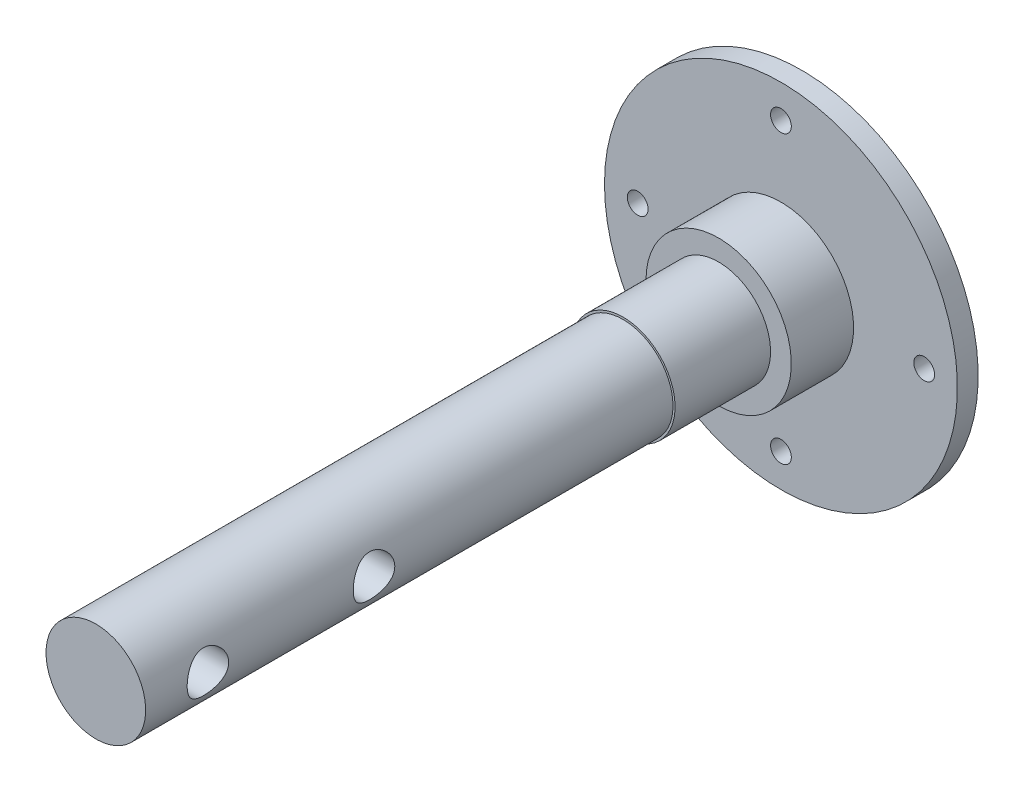
ISO-10303-21;
HEADER;
FILE_DESCRIPTION(('STEP AP214'),'2;1');
FILE_NAME('part.step','',(''),(''),'','','');
FILE_SCHEMA(('AUTOMOTIVE_DESIGN { 1 0 10303 214 1 1 1 1 }'));
ENDSEC;
DATA;
#1=APPLICATION_CONTEXT('core data for automotive mechanical design processes');
#2=APPLICATION_PROTOCOL_DEFINITION('international standard','automotive_design',2000,#1);
#3=PRODUCT_CONTEXT('',#1,'mechanical');
#4=PRODUCT('Part','Part','',(#3));
#5=PRODUCT_RELATED_PRODUCT_CATEGORY('part','',(#4));
#6=PRODUCT_DEFINITION_FORMATION('','',#4);
#7=PRODUCT_DEFINITION_CONTEXT('part definition',#1,'design');
#8=PRODUCT_DEFINITION('design','',#6,#7);
#9=PRODUCT_DEFINITION_SHAPE('','',#8);
#10=(LENGTH_UNIT() NAMED_UNIT(*) SI_UNIT(.MILLI.,.METRE.));
#11=(NAMED_UNIT(*) PLANE_ANGLE_UNIT() SI_UNIT($,.RADIAN.));
#12=(NAMED_UNIT(*) SI_UNIT($,.STERADIAN.) SOLID_ANGLE_UNIT());
#13=UNCERTAINTY_MEASURE_WITH_UNIT(LENGTH_MEASURE(1.E-05),#10,'distance_accuracy_value','');
#14=(GEOMETRIC_REPRESENTATION_CONTEXT(3) GLOBAL_UNCERTAINTY_ASSIGNED_CONTEXT((#13)) GLOBAL_UNIT_ASSIGNED_CONTEXT((#10,
#11,#12)) REPRESENTATION_CONTEXT('',''));
#15=CARTESIAN_POINT('',(0.,0.,0.));
#16=DIRECTION('',(0.,0.,1.));
#17=DIRECTION('',(1.,0.,0.));
#18=AXIS2_PLACEMENT_3D('',#15,#16,#17);
#19=CARTESIAN_POINT('',(0.,0.,34.));
#20=DIRECTION('',(0.,0.,1.));
#21=DIRECTION('',(1.,0.,0.));
#22=AXIS2_PLACEMENT_3D('',#19,#20,#21);
#23=PLANE('',#22);
#24=CARTESIAN_POINT('',(0.,0.,34.));
#25=DIRECTION('',(0.,0.,-1.));
#26=DIRECTION('',(-1.,0.,0.));
#27=AXIS2_PLACEMENT_3D('',#24,#25,#26);
#28=CIRCLE('',#27,2.4);
#29=CARTESIAN_POINT('',(-2.4,0.,34.));
#30=VERTEX_POINT('',#29);
#31=EDGE_CURVE('E18',#30,#30,#28,.T.);
#32=ORIENTED_EDGE('',*,*,#31,.F.);
#33=EDGE_LOOP('',(#32));
#34=FACE_BOUND('',#33,.T.);
#35=ADVANCED_FACE('F15',(#34),#23,.T.);
#36=CARTESIAN_POINT('',(-5.,0.,23.));
#37=DIRECTION('',(1.,0.,0.));
#38=DIRECTION('',(0.,0.,-1.));
#39=AXIS2_PLACEMENT_3D('',#36,#37,#38);
#40=CYLINDRICAL_SURFACE('',#39,1.);
#41=CARTESIAN_POINT('',(2.4,0.,22.));
#42=CARTESIAN_POINT('',(2.39999748115499,-0.0536228229681952,22.0000031120945));
#43=CARTESIAN_POINT('',(2.39818405700705,-0.107290047970871,22.0043342886357));
#44=CARTESIAN_POINT('',(2.39111423650814,-0.213056456016588,22.0214878732844));
#45=CARTESIAN_POINT('',(2.38585312144098,-0.26515338749602,22.0343219191932));
#46=CARTESIAN_POINT('',(2.37245149783701,-0.366144614490716,22.0679260271083));
#47=CARTESIAN_POINT('',(2.36431941079012,-0.415047786425472,22.0886728923997));
#48=CARTESIAN_POINT('',(2.34596548673147,-0.508649233344384,22.1374094613354));
#49=CARTESIAN_POINT('',(2.33574362342609,-0.553347455411432,22.1653992561116));
#50=CARTESIAN_POINT('',(2.31366222748149,-0.639560449319656,22.2293043569717));
#51=CARTESIAN_POINT('',(2.30174916747518,-0.680836032559526,22.2655236631235));
#52=CARTESIAN_POINT('',(2.27786084549728,-0.756930336478763,22.3442145378866));
#53=CARTESIAN_POINT('',(2.26588555780819,-0.79174612566388,22.3866889294875));
#54=CARTESIAN_POINT('',(2.24256824971376,-0.855629707085259,22.4792211252902));
#55=CARTESIAN_POINT('',(2.2312864351002,-0.884330111596901,22.5295493330614));
#56=CARTESIAN_POINT('',(2.21148468454706,-0.932751277448271,22.6348579253734));
#57=CARTESIAN_POINT('',(2.20296336043388,-0.952476554154447,22.689835954053));
#58=CARTESIAN_POINT('',(2.19022844559474,-0.981396781528443,22.8001229312771));
#59=CARTESIAN_POINT('',(2.18582710483227,-0.991053255415082,22.8552883405939));
#60=CARTESIAN_POINT('',(2.18129060994145,-1.00100167901162,22.9666185870403));
#61=CARTESIAN_POINT('',(2.1811531065847,-1.0012987854139,23.0227828567629));
#62=CARTESIAN_POINT('',(2.18500095572869,-0.992867605320561,23.1299200277));
#63=CARTESIAN_POINT('',(2.18867105883877,-0.98482945796529,23.1809608360927));
#64=CARTESIAN_POINT('',(2.19918785658243,-0.961113538189813,23.2808896333573));
#65=CARTESIAN_POINT('',(2.20603516210821,-0.945434296559616,23.3297772062386));
#66=CARTESIAN_POINT('',(2.22228963087426,-0.906575315154445,23.4252470574655));
#67=CARTESIAN_POINT('',(2.23174820770071,-0.883242942831145,23.4717580625766));
#68=CARTESIAN_POINT('',(2.25214705637918,-0.829848782644929,23.5603837598593));
#69=CARTESIAN_POINT('',(2.26308785714146,-0.799784590117635,23.602496873164));
#70=CARTESIAN_POINT('',(2.28634218605606,-0.730801761909807,23.6848741796629));
#71=CARTESIAN_POINT('',(2.29869364393779,-0.691350023532405,23.7246824656548));
#72=CARTESIAN_POINT('',(2.32260225864821,-0.606195421244399,23.7972819948124));
#73=CARTESIAN_POINT('',(2.3341590127733,-0.560489422651674,23.8300696979388));
#74=CARTESIAN_POINT('',(2.3555141309457,-0.462724683987973,23.8883699007824));
#75=CARTESIAN_POINT('',(2.36526436029952,-0.410541111858581,23.9136916782912));
#76=CARTESIAN_POINT('',(2.38152535186786,-0.302191305642431,23.9550010594861));
#77=CARTESIAN_POINT('',(2.38804256748526,-0.246033263254989,23.9710072690903));
#78=CARTESIAN_POINT('',(2.39501243620749,-0.157774818150987,23.9879829693992));
#79=CARTESIAN_POINT('',(2.39687553856488,-0.126423862499731,23.9924815819576));
#80=CARTESIAN_POINT('',(2.3993700552114,-0.0633871072702041,23.9984909933851));
#81=CARTESIAN_POINT('',(2.40000148911769,-0.0317013130330916,24.0000018398412));
#82=CARTESIAN_POINT('',(2.39999748115499,0.0536228229681957,23.9999968879055));
#83=CARTESIAN_POINT('',(2.39818405700705,0.107290047970872,23.9956657113643));
#84=CARTESIAN_POINT('',(2.39111423650814,0.213056456016588,23.9785121267156));
#85=CARTESIAN_POINT('',(2.38585312144098,0.26515338749602,23.9656780808068));
#86=CARTESIAN_POINT('',(2.37245149783701,0.366144614490716,23.9320739728917));
#87=CARTESIAN_POINT('',(2.36431941079012,0.415047786425473,23.9113271076003));
#88=CARTESIAN_POINT('',(2.34596548673147,0.508649233344385,23.8625905386646));
#89=CARTESIAN_POINT('',(2.33574362342609,0.553347455411433,23.8346007438884));
#90=CARTESIAN_POINT('',(2.31366222748149,0.639560449319656,23.7706956430283));
#91=CARTESIAN_POINT('',(2.30174916747518,0.680836032559526,23.7344763368765));
#92=CARTESIAN_POINT('',(2.27786084549728,0.756930336478764,23.6557854621134));
#93=CARTESIAN_POINT('',(2.26588555780819,0.791746125663881,23.6133110705125));
#94=CARTESIAN_POINT('',(2.24256824971376,0.855629707085261,23.5207788747098));
#95=CARTESIAN_POINT('',(2.2312864351002,0.884330111596903,23.4704506669385));
#96=CARTESIAN_POINT('',(2.21148468454706,0.932751277448272,23.3651420746266));
#97=CARTESIAN_POINT('',(2.20296336043388,0.952476554154447,23.310164045947));
#98=CARTESIAN_POINT('',(2.19022844559474,0.981396781528443,23.1998770687229));
#99=CARTESIAN_POINT('',(2.18582710483227,0.991053255415082,23.1447116594061));
#100=CARTESIAN_POINT('',(2.18129060994145,1.00100167901162,23.0333814129597));
#101=CARTESIAN_POINT('',(2.1811531065847,1.0012987854139,22.9772171432371));
#102=CARTESIAN_POINT('',(2.18500095572869,0.992867605320561,22.8700799723));
#103=CARTESIAN_POINT('',(2.18867105883877,0.984829457965289,22.8190391639073));
#104=CARTESIAN_POINT('',(2.19918785658243,0.961113538189813,22.7191103666427));
#105=CARTESIAN_POINT('',(2.20603516210821,0.945434296559616,22.6702227937614));
#106=CARTESIAN_POINT('',(2.22228963087426,0.906575315154445,22.5747529425345));
#107=CARTESIAN_POINT('',(2.23174820770071,0.883242942831145,22.5282419374234));
#108=CARTESIAN_POINT('',(2.25214705637918,0.829848782644929,22.4396162401407));
#109=CARTESIAN_POINT('',(2.26308785714146,0.799784590117635,22.397503126836));
#110=CARTESIAN_POINT('',(2.28634218605606,0.730801761909807,22.3151258203371));
#111=CARTESIAN_POINT('',(2.29869364393779,0.691350023532405,22.2753175343452));
#112=CARTESIAN_POINT('',(2.32260225864821,0.6061954212444,22.2027180051876));
#113=CARTESIAN_POINT('',(2.3341590127733,0.560489422651675,22.1699303020612));
#114=CARTESIAN_POINT('',(2.3555141309457,0.462724683987973,22.1116300992176));
#115=CARTESIAN_POINT('',(2.36526436029952,0.410541111858581,22.0863083217088));
#116=CARTESIAN_POINT('',(2.38152535186786,0.302191305642431,22.0449989405139));
#117=CARTESIAN_POINT('',(2.38804256748526,0.246033263254989,22.0289927309097));
#118=CARTESIAN_POINT('',(2.39501243620749,0.157774818150987,22.0120170306008));
#119=CARTESIAN_POINT('',(2.39687553856488,0.126423862499731,22.0075184180424));
#120=CARTESIAN_POINT('',(2.3993700552114,0.0633871072702043,22.0015090066149));
#121=CARTESIAN_POINT('',(2.40000148911769,0.0317013130330918,21.9999981601588));
#122=CARTESIAN_POINT('',(2.4,0.,22.));
#123=B_SPLINE_CURVE_WITH_KNOTS('',3,(#41,#42,#43,#44,#45,#46,#47,#48,#49,#50,#51,#52,#53,#54,
#55,#56,#57,#58,#59,#60,#61,#62,#63,#64,#65,#66,#67,#68,#69,#70,#71,#72,#73,#74,#75,#76,#77,#78,
#79,#80,#81,#82,#83,#84,#85,#86,#87,#88,#89,#90,#91,#92,#93,#94,#95,#96,#97,#98,#99,#100,#101,
#102,#103,#104,#105,#106,#107,#108,#109,#110,#111,#112,#113,#114,#115,#116,#117,#118,#119,#120,
#121,#122),.UNSPECIFIED.,.T.,.F.,(4,2,2,2,2,2,2,2,2,2,2,2,2,2,2,2,2,2,2,2,2,2,2,2,2,2,2,2,2,2,2,
2,2,2,2,2,2,2,2,2,4),(0.,0.160745178571958,0.321710823406614,0.482208174194472,
0.642707544487954,0.810549531057266,0.978467500046993,1.15465270263012,1.33074916856349,
1.49836210995007,1.66588270070444,1.82056119016139,1.97526943254251,2.13327263110284,
2.29133236006593,2.46273006219595,2.63421398696243,2.80975981529697,2.98495381316104,
3.07998637779003,3.17501742879404,3.335762607366,3.49672825220066,3.65722560298852,
3.817724973282,3.98556695985131,4.15348492884104,4.32967013142416,4.50576659735754,
4.67337953874412,4.84090012949848,4.99557861895544,5.15028686133656,5.30829005989688,
5.46634978885998,5.63774749098999,5.80923141575648,5.98477724409101,6.15997124195508,
6.25500380658407,6.35003485758809),.UNSPECIFIED.);
#124=CARTESIAN_POINT('',(2.4,0.,22.));
#125=VERTEX_POINT('',#124);
#126=EDGE_CURVE('E75',#125,#125,#123,.T.);
#127=ORIENTED_EDGE('',*,*,#126,.F.);
#128=EDGE_LOOP('',(#127));
#129=FACE_BOUND('',#128,.T.);
#130=CARTESIAN_POINT('',(-2.4,0.,24.));
#131=CARTESIAN_POINT('',(-2.39999748115499,-0.0536228229681954,23.9999968879055));
#132=CARTESIAN_POINT('',(-2.39818405700705,-0.107290047970871,23.9956657113643));
#133=CARTESIAN_POINT('',(-2.39111423650814,-0.213056456016588,23.9785121267156));
#134=CARTESIAN_POINT('',(-2.38585312144098,-0.26515338749602,23.9656780808068));
#135=CARTESIAN_POINT('',(-2.37245149783701,-0.366144614490716,23.9320739728917));
#136=CARTESIAN_POINT('',(-2.36431941079012,-0.415047786425472,23.9113271076003));
#137=CARTESIAN_POINT('',(-2.34596548673147,-0.508649233344384,23.8625905386646));
#138=CARTESIAN_POINT('',(-2.33574362342609,-0.553347455411432,23.8346007438884));
#139=CARTESIAN_POINT('',(-2.31366222748149,-0.639560449319655,23.7706956430283));
#140=CARTESIAN_POINT('',(-2.30174916747518,-0.680836032559525,23.7344763368765));
#141=CARTESIAN_POINT('',(-2.27786084549728,-0.756930336478762,23.6557854621134));
#142=CARTESIAN_POINT('',(-2.26588555780819,-0.791746125663879,23.6133110705125));
#143=CARTESIAN_POINT('',(-2.24256824971376,-0.855629707085259,23.5207788747098));
#144=CARTESIAN_POINT('',(-2.2312864351002,-0.8843301115969,23.4704506669386));
#145=CARTESIAN_POINT('',(-2.21148468454706,-0.932751277448271,23.3651420746266));
#146=CARTESIAN_POINT('',(-2.20296336043388,-0.952476554154446,23.310164045947));
#147=CARTESIAN_POINT('',(-2.19022844559474,-0.981396781528443,23.1998770687229));
#148=CARTESIAN_POINT('',(-2.18582710483227,-0.991053255415082,23.1447116594061));
#149=CARTESIAN_POINT('',(-2.18129060994145,-1.00100167901162,23.0333814129597));
#150=CARTESIAN_POINT('',(-2.1811531065847,-1.0012987854139,22.9772171432371));
#151=CARTESIAN_POINT('',(-2.18500095572869,-0.992867605320561,22.8700799723));
#152=CARTESIAN_POINT('',(-2.18867105883877,-0.984829457965289,22.8190391639073));
#153=CARTESIAN_POINT('',(-2.19918785658243,-0.961113538189812,22.7191103666427));
#154=CARTESIAN_POINT('',(-2.20603516210821,-0.945434296559616,22.6702227937614));
#155=CARTESIAN_POINT('',(-2.22228963087426,-0.906575315154445,22.5747529425345));
#156=CARTESIAN_POINT('',(-2.23174820770071,-0.883242942831145,22.5282419374234));
#157=CARTESIAN_POINT('',(-2.25214705637918,-0.829848782644929,22.4396162401407));
#158=CARTESIAN_POINT('',(-2.26308785714146,-0.799784590117635,22.397503126836));
#159=CARTESIAN_POINT('',(-2.28634218605606,-0.730801761909807,22.3151258203371));
#160=CARTESIAN_POINT('',(-2.29869364393779,-0.691350023532405,22.2753175343452));
#161=CARTESIAN_POINT('',(-2.32260225864821,-0.606195421244399,22.2027180051876));
#162=CARTESIAN_POINT('',(-2.3341590127733,-0.560489422651674,22.1699303020612));
#163=CARTESIAN_POINT('',(-2.3555141309457,-0.462724683987973,22.1116300992176));
#164=CARTESIAN_POINT('',(-2.36526436029952,-0.410541111858581,22.0863083217088));
#165=CARTESIAN_POINT('',(-2.38152535186786,-0.302191305642431,22.0449989405139));
#166=CARTESIAN_POINT('',(-2.38804256748526,-0.246033263254989,22.0289927309097));
#167=CARTESIAN_POINT('',(-2.39501243620749,-0.157774818150987,22.0120170306008));
#168=CARTESIAN_POINT('',(-2.39687553856488,-0.126423862499731,22.0075184180424));
#169=CARTESIAN_POINT('',(-2.3993700552114,-0.0633871072702043,22.0015090066149));
#170=CARTESIAN_POINT('',(-2.40000148911769,-0.0317013130330918,21.9999981601588));
#171=CARTESIAN_POINT('',(-2.39999748115499,0.0536228229681952,22.0000031120945));
#172=CARTESIAN_POINT('',(-2.39818405700705,0.107290047970871,22.0043342886357));
#173=CARTESIAN_POINT('',(-2.39111423650814,0.213056456016588,22.0214878732844));
#174=CARTESIAN_POINT('',(-2.38585312144098,0.26515338749602,22.0343219191932));
#175=CARTESIAN_POINT('',(-2.37245149783701,0.366144614490715,22.0679260271083));
#176=CARTESIAN_POINT('',(-2.36431941079012,0.415047786425472,22.0886728923997));
#177=CARTESIAN_POINT('',(-2.34596548673147,0.508649233344384,22.1374094613354));
#178=CARTESIAN_POINT('',(-2.33574362342609,0.553347455411432,22.1653992561116));
#179=CARTESIAN_POINT('',(-2.31366222748149,0.639560449319656,22.2293043569717));
#180=CARTESIAN_POINT('',(-2.30174916747518,0.680836032559526,22.2655236631235));
#181=CARTESIAN_POINT('',(-2.27786084549728,0.756930336478763,22.3442145378866));
#182=CARTESIAN_POINT('',(-2.26588555780819,0.79174612566388,22.3866889294875));
#183=CARTESIAN_POINT('',(-2.24256824971376,0.85562970708526,22.4792211252902));
#184=CARTESIAN_POINT('',(-2.2312864351002,0.884330111596902,22.5295493330615));
#185=CARTESIAN_POINT('',(-2.21148468454706,0.932751277448272,22.6348579253734));
#186=CARTESIAN_POINT('',(-2.20296336043388,0.952476554154447,22.689835954053));
#187=CARTESIAN_POINT('',(-2.19022844559474,0.981396781528443,22.8001229312771));
#188=CARTESIAN_POINT('',(-2.18582710483227,0.991053255415082,22.8552883405939));
#189=CARTESIAN_POINT('',(-2.18129060994145,1.00100167901162,22.9666185870403));
#190=CARTESIAN_POINT('',(-2.1811531065847,1.0012987854139,23.0227828567629));
#191=CARTESIAN_POINT('',(-2.18500095572869,0.992867605320561,23.1299200277));
#192=CARTESIAN_POINT('',(-2.18867105883877,0.984829457965289,23.1809608360927));
#193=CARTESIAN_POINT('',(-2.19918785658243,0.961113538189812,23.2808896333573));
#194=CARTESIAN_POINT('',(-2.20603516210821,0.945434296559616,23.3297772062386));
#195=CARTESIAN_POINT('',(-2.22228963087426,0.906575315154445,23.4252470574655));
#196=CARTESIAN_POINT('',(-2.23174820770071,0.883242942831145,23.4717580625766));
#197=CARTESIAN_POINT('',(-2.25214705637918,0.829848782644929,23.5603837598593));
#198=CARTESIAN_POINT('',(-2.26308785714146,0.799784590117635,23.602496873164));
#199=CARTESIAN_POINT('',(-2.28634218605606,0.730801761909807,23.6848741796629));
#200=CARTESIAN_POINT('',(-2.29869364393779,0.691350023532405,23.7246824656548));
#201=CARTESIAN_POINT('',(-2.32260225864821,0.606195421244399,23.7972819948124));
#202=CARTESIAN_POINT('',(-2.3341590127733,0.560489422651674,23.8300696979388));
#203=CARTESIAN_POINT('',(-2.3555141309457,0.462724683987973,23.8883699007824));
#204=CARTESIAN_POINT('',(-2.36526436029952,0.410541111858581,23.9136916782912));
#205=CARTESIAN_POINT('',(-2.38152535186786,0.302191305642431,23.9550010594861));
#206=CARTESIAN_POINT('',(-2.38804256748526,0.246033263254989,23.9710072690903));
#207=CARTESIAN_POINT('',(-2.39501243620749,0.157774818150987,23.9879829693992));
#208=CARTESIAN_POINT('',(-2.39687553856488,0.12642386249973,23.9924815819576));
#209=CARTESIAN_POINT('',(-2.3993700552114,0.0633871072702039,23.9984909933851));
#210=CARTESIAN_POINT('',(-2.40000148911769,0.0317013130330916,24.0000018398412));
#211=CARTESIAN_POINT('',(-2.4,0.,24.));
#212=B_SPLINE_CURVE_WITH_KNOTS('',3,(#130,#131,#132,#133,#134,#135,#136,#137,#138,#139,#140,
#141,#142,#143,#144,#145,#146,#147,#148,#149,#150,#151,#152,#153,#154,#155,#156,#157,#158,#159,
#160,#161,#162,#163,#164,#165,#166,#167,#168,#169,#170,#171,#172,#173,#174,#175,#176,#177,#178,
#179,#180,#181,#182,#183,#184,#185,#186,#187,#188,#189,#190,#191,#192,#193,#194,#195,#196,#197,
#198,#199,#200,#201,#202,#203,#204,#205,#206,#207,#208,#209,#210,#211),.UNSPECIFIED.,.T.,.F.,(4,
2,2,2,2,2,2,2,2,2,2,2,2,2,2,2,2,2,2,2,2,2,2,2,2,2,2,2,2,2,2,2,2,2,2,2,2,2,2,2,4),(0.,
0.160745178571958,0.321710823406614,0.482208174194472,0.642707544487954,0.810549531057265,
0.978467500046993,1.15465270263011,1.33074916856349,1.49836210995007,1.66588270070444,
1.82056119016139,1.97526943254251,2.13327263110284,2.29133236006593,2.46273006219595,
2.63421398696243,2.80975981529697,2.98495381316104,3.07998637779003,3.17501742879404,
3.335762607366,3.49672825220066,3.65722560298852,3.817724973282,3.98556695985131,
4.15348492884104,4.32967013142416,4.50576659735753,4.67337953874412,4.84090012949848,
4.99557861895544,5.15028686133656,5.30829005989688,5.46634978885998,5.63774749099,
5.80923141575648,5.98477724409101,6.15997124195508,6.25500380658407,6.35003485758809),.UNSPECIFIED.);
#213=CARTESIAN_POINT('',(-2.4,0.,24.));
#214=VERTEX_POINT('',#213);
#215=EDGE_CURVE('E94',#214,#214,#212,.T.);
#216=ORIENTED_EDGE('',*,*,#215,.F.);
#217=EDGE_LOOP('',(#216));
#218=FACE_BOUND('',#217,.T.);
#219=ADVANCED_FACE('F98',(#129,#218),#40,.F.);
#220=CARTESIAN_POINT('',(-5.,0.,31.));
#221=DIRECTION('',(1.,0.,0.));
#222=DIRECTION('',(0.,0.,-1.));
#223=AXIS2_PLACEMENT_3D('',#220,#221,#222);
#224=CYLINDRICAL_SURFACE('',#223,1.);
#225=CARTESIAN_POINT('',(2.4,0.,30.));
#226=CARTESIAN_POINT('',(2.39999748115499,-0.0536228229681952,30.0000031120945));
#227=CARTESIAN_POINT('',(2.39818405700705,-0.107290047970871,30.0043342886357));
#228=CARTESIAN_POINT('',(2.39111423650814,-0.213056456016588,30.0214878732844));
#229=CARTESIAN_POINT('',(2.38585312144098,-0.26515338749602,30.0343219191932));
#230=CARTESIAN_POINT('',(2.37245149783701,-0.366144614490716,30.0679260271083));
#231=CARTESIAN_POINT('',(2.36431941079012,-0.415047786425472,30.0886728923997));
#232=CARTESIAN_POINT('',(2.34596548673147,-0.508649233344384,30.1374094613354));
#233=CARTESIAN_POINT('',(2.33574362342609,-0.553347455411432,30.1653992561116));
#234=CARTESIAN_POINT('',(2.31366222748149,-0.639560449319656,30.2293043569717));
#235=CARTESIAN_POINT('',(2.30174916747518,-0.680836032559526,30.2655236631235));
#236=CARTESIAN_POINT('',(2.27786084549728,-0.756930336478763,30.3442145378866));
#237=CARTESIAN_POINT('',(2.26588555780819,-0.79174612566388,30.3866889294875));
#238=CARTESIAN_POINT('',(2.24256824971376,-0.855629707085259,30.4792211252902));
#239=CARTESIAN_POINT('',(2.2312864351002,-0.884330111596901,30.5295493330614));
#240=CARTESIAN_POINT('',(2.21148468454706,-0.932751277448271,30.6348579253734));
#241=CARTESIAN_POINT('',(2.20296336043388,-0.952476554154447,30.689835954053));
#242=CARTESIAN_POINT('',(2.19022844559474,-0.981396781528443,30.8001229312771));
#243=CARTESIAN_POINT('',(2.18582710483227,-0.991053255415082,30.8552883405939));
#244=CARTESIAN_POINT('',(2.18129060994145,-1.00100167901162,30.9666185870403));
#245=CARTESIAN_POINT('',(2.1811531065847,-1.0012987854139,31.0227828567629));
#246=CARTESIAN_POINT('',(2.18500095572869,-0.992867605320561,31.1299200277));
#247=CARTESIAN_POINT('',(2.18867105883877,-0.984829457965289,31.1809608360927));
#248=CARTESIAN_POINT('',(2.19918785658243,-0.961113538189812,31.2808896333573));
#249=CARTESIAN_POINT('',(2.20603516210821,-0.945434296559615,31.3297772062386));
#250=CARTESIAN_POINT('',(2.22228963087426,-0.906575315154444,31.4252470574655));
#251=CARTESIAN_POINT('',(2.23174820770071,-0.883242942831145,31.4717580625766));
#252=CARTESIAN_POINT('',(2.25214705637918,-0.829848782644929,31.5603837598593));
#253=CARTESIAN_POINT('',(2.26308785714146,-0.799784590117634,31.602496873164));
#254=CARTESIAN_POINT('',(2.28634218605606,-0.730801761909805,31.6848741796629));
#255=CARTESIAN_POINT('',(2.29869364393779,-0.691350023532403,31.7246824656548));
#256=CARTESIAN_POINT('',(2.32260225864821,-0.606195421244397,31.7972819948124));
#257=CARTESIAN_POINT('',(2.3341590127733,-0.560489422651671,31.8300696979388));
#258=CARTESIAN_POINT('',(2.3555141309457,-0.46272468398797,31.8883699007824));
#259=CARTESIAN_POINT('',(2.36526436029953,-0.410541111858579,31.9136916782912));
#260=CARTESIAN_POINT('',(2.38152535186786,-0.30219130564243,31.9550010594861));
#261=CARTESIAN_POINT('',(2.38804256748526,-0.246033263254987,31.9710072690903));
#262=CARTESIAN_POINT('',(2.39501243620749,-0.157774818150987,31.9879829693992));
#263=CARTESIAN_POINT('',(2.39687553856488,-0.126423862499731,31.9924815819576));
#264=CARTESIAN_POINT('',(2.3993700552114,-0.0633871072702047,31.9984909933851));
#265=CARTESIAN_POINT('',(2.40000148911769,-0.0317013130330915,32.0000018398412));
#266=CARTESIAN_POINT('',(2.39999748115499,0.0536228229681959,31.9999968879055));
#267=CARTESIAN_POINT('',(2.39818405700705,0.107290047970872,31.9956657113643));
#268=CARTESIAN_POINT('',(2.39111423650814,0.213056456016587,31.9785121267156));
#269=CARTESIAN_POINT('',(2.38585312144098,0.265153387496019,31.9656780808068));
#270=CARTESIAN_POINT('',(2.37245149783701,0.366144614490715,31.9320739728918));
#271=CARTESIAN_POINT('',(2.36431941079012,0.415047786425472,31.9113271076003));
#272=CARTESIAN_POINT('',(2.34596548673147,0.508649233344383,31.8625905386646));
#273=CARTESIAN_POINT('',(2.33574362342609,0.553347455411429,31.8346007438884));
#274=CARTESIAN_POINT('',(2.31366222748149,0.639560449319653,31.7706956430283));
#275=CARTESIAN_POINT('',(2.30174916747518,0.680836032559526,31.7344763368765));
#276=CARTESIAN_POINT('',(2.27786084549728,0.756930336478763,31.6557854621134));
#277=CARTESIAN_POINT('',(2.26588555780819,0.791746125663879,31.6133110705125));
#278=CARTESIAN_POINT('',(2.24256824971376,0.855629707085257,31.5207788747098));
#279=CARTESIAN_POINT('',(2.2312864351002,0.884330111596899,31.4704506669386));
#280=CARTESIAN_POINT('',(2.21148468454706,0.932751277448269,31.3651420746266));
#281=CARTESIAN_POINT('',(2.20296336043388,0.952476554154445,31.310164045947));
#282=CARTESIAN_POINT('',(2.19022844559474,0.981396781528442,31.1998770687229));
#283=CARTESIAN_POINT('',(2.18582710483227,0.991053255415082,31.1447116594061));
#284=CARTESIAN_POINT('',(2.18129060994144,1.00100167901162,31.0333814129597));
#285=CARTESIAN_POINT('',(2.1811531065847,1.0012987854139,30.9772171432371));
#286=CARTESIAN_POINT('',(2.18500095572869,0.992867605320562,30.8700799723));
#287=CARTESIAN_POINT('',(2.18867105883877,0.98482945796529,30.8190391639073));
#288=CARTESIAN_POINT('',(2.19918785658243,0.961113538189814,30.7191103666427));
#289=CARTESIAN_POINT('',(2.20603516210821,0.945434296559617,30.6702227937614));
#290=CARTESIAN_POINT('',(2.22228963087426,0.906575315154446,30.5747529425345));
#291=CARTESIAN_POINT('',(2.23174820770071,0.883242942831146,30.5282419374234));
#292=CARTESIAN_POINT('',(2.25214705637918,0.829848782644929,30.4396162401407));
#293=CARTESIAN_POINT('',(2.26308785714146,0.799784590117635,30.397503126836));
#294=CARTESIAN_POINT('',(2.28634218605606,0.730801761909807,30.3151258203371));
#295=CARTESIAN_POINT('',(2.29869364393779,0.691350023532405,30.2753175343452));
#296=CARTESIAN_POINT('',(2.32260225864821,0.6061954212444,30.2027180051876));
#297=CARTESIAN_POINT('',(2.3341590127733,0.560489422651675,30.1699303020612));
#298=CARTESIAN_POINT('',(2.3555141309457,0.462724683987974,30.1116300992176));
#299=CARTESIAN_POINT('',(2.36526436029952,0.410541111858583,30.0863083217088));
#300=CARTESIAN_POINT('',(2.38152535186786,0.302191305642433,30.0449989405139));
#301=CARTESIAN_POINT('',(2.38804256748526,0.24603326325499,30.0289927309097));
#302=CARTESIAN_POINT('',(2.39501243620749,0.157774818150988,30.0120170306008));
#303=CARTESIAN_POINT('',(2.39687553856488,0.126423862499732,30.0075184180424));
#304=CARTESIAN_POINT('',(2.3993700552114,0.0633871072702053,30.0015090066149));
#305=CARTESIAN_POINT('',(2.40000148911769,0.0317013130330923,29.9999981601588));
#306=CARTESIAN_POINT('',(2.4,0.,30.));
#307=B_SPLINE_CURVE_WITH_KNOTS('',3,(#225,#226,#227,#228,#229,#230,#231,#232,#233,#234,#235,
#236,#237,#238,#239,#240,#241,#242,#243,#244,#245,#246,#247,#248,#249,#250,#251,#252,#253,#254,
#255,#256,#257,#258,#259,#260,#261,#262,#263,#264,#265,#266,#267,#268,#269,#270,#271,#272,#273,
#274,#275,#276,#277,#278,#279,#280,#281,#282,#283,#284,#285,#286,#287,#288,#289,#290,#291,#292,
#293,#294,#295,#296,#297,#298,#299,#300,#301,#302,#303,#304,#305,#306),.UNSPECIFIED.,.T.,.F.,(4,
2,2,2,2,2,2,2,2,2,2,2,2,2,2,2,2,2,2,2,2,2,2,2,2,2,2,2,2,2,2,2,2,2,2,2,2,2,2,2,4),(0.,
0.160745178571958,0.321710823406614,0.482208174194472,0.642707544487954,0.810549531057266,
0.978467500046993,1.15465270263012,1.33074916856349,1.49836210995007,1.66588270070444,
1.82056119016139,1.97526943254252,2.13327263110283,2.29133236006593,2.46273006219595,
2.63421398696244,2.80975981529697,2.98495381316104,3.07998637779003,3.17501742879404,
3.335762607366,3.49672825220066,3.65722560298851,3.817724973282,3.98556695985131,
4.15348492884104,4.32967013142416,4.50576659735752,4.67337953874411,4.84090012949848,
4.99557861895543,5.15028686133655,5.30829005989688,5.46634978885998,5.63774749099,
5.80923141575648,5.98477724409101,6.15997124195508,6.25500380658407,6.35003485758809),.UNSPECIFIED.);
#308=CARTESIAN_POINT('',(2.4,0.,30.));
#309=VERTEX_POINT('',#308);
#310=EDGE_CURVE('E68',#309,#309,#307,.T.);
#311=ORIENTED_EDGE('',*,*,#310,.F.);
#312=EDGE_LOOP('',(#311));
#313=FACE_BOUND('',#312,.T.);
#314=CARTESIAN_POINT('',(-2.4,0.,32.));
#315=CARTESIAN_POINT('',(-2.39999748115499,-0.0536228229681953,31.9999968879055));
#316=CARTESIAN_POINT('',(-2.39818405700705,-0.107290047970871,31.9956657113643));
#317=CARTESIAN_POINT('',(-2.39111423650814,-0.213056456016588,31.9785121267156));
#318=CARTESIAN_POINT('',(-2.38585312144098,-0.26515338749602,31.9656780808068));
#319=CARTESIAN_POINT('',(-2.37245149783701,-0.366144614490716,31.9320739728918));
#320=CARTESIAN_POINT('',(-2.36431941079012,-0.415047786425471,31.9113271076003));
#321=CARTESIAN_POINT('',(-2.34596548673147,-0.508649233344384,31.8625905386646));
#322=CARTESIAN_POINT('',(-2.33574362342609,-0.553347455411432,31.8346007438884));
#323=CARTESIAN_POINT('',(-2.31366222748149,-0.639560449319656,31.7706956430283));
#324=CARTESIAN_POINT('',(-2.30174916747518,-0.680836032559526,31.7344763368765));
#325=CARTESIAN_POINT('',(-2.27786084549728,-0.756930336478763,31.6557854621134));
#326=CARTESIAN_POINT('',(-2.26588555780819,-0.791746125663881,31.6133110705125));
#327=CARTESIAN_POINT('',(-2.24256824971376,-0.85562970708526,31.5207788747098));
#328=CARTESIAN_POINT('',(-2.2312864351002,-0.8843301115969,31.4704506669386));
#329=CARTESIAN_POINT('',(-2.21148468454706,-0.93275127744827,31.3651420746266));
#330=CARTESIAN_POINT('',(-2.20296336043388,-0.952476554154446,31.310164045947));
#331=CARTESIAN_POINT('',(-2.19022844559474,-0.981396781528443,31.1998770687229));
#332=CARTESIAN_POINT('',(-2.18582710483227,-0.991053255415082,31.1447116594061));
#333=CARTESIAN_POINT('',(-2.18129060994145,-1.00100167901162,31.0333814129597));
#334=CARTESIAN_POINT('',(-2.1811531065847,-1.0012987854139,30.9772171432371));
#335=CARTESIAN_POINT('',(-2.18500095572869,-0.992867605320561,30.8700799723));
#336=CARTESIAN_POINT('',(-2.18867105883877,-0.984829457965289,30.8190391639073));
#337=CARTESIAN_POINT('',(-2.19918785658243,-0.961113538189812,30.7191103666427));
#338=CARTESIAN_POINT('',(-2.20603516210821,-0.945434296559616,30.6702227937614));
#339=CARTESIAN_POINT('',(-2.22228963087426,-0.906575315154445,30.5747529425345));
#340=CARTESIAN_POINT('',(-2.23174820770071,-0.883242942831145,30.5282419374234));
#341=CARTESIAN_POINT('',(-2.25214705637918,-0.829848782644929,30.4396162401407));
#342=CARTESIAN_POINT('',(-2.26308785714146,-0.799784590117635,30.397503126836));
#343=CARTESIAN_POINT('',(-2.28634218605606,-0.730801761909807,30.3151258203371));
#344=CARTESIAN_POINT('',(-2.29869364393779,-0.691350023532405,30.2753175343452));
#345=CARTESIAN_POINT('',(-2.32260225864821,-0.606195421244399,30.2027180051876));
#346=CARTESIAN_POINT('',(-2.3341590127733,-0.560489422651674,30.1699303020612));
#347=CARTESIAN_POINT('',(-2.3555141309457,-0.462724683987973,30.1116300992176));
#348=CARTESIAN_POINT('',(-2.36526436029952,-0.410541111858581,30.0863083217088));
#349=CARTESIAN_POINT('',(-2.38152535186786,-0.302191305642431,30.0449989405139));
#350=CARTESIAN_POINT('',(-2.38804256748526,-0.246033263254988,30.0289927309097));
#351=CARTESIAN_POINT('',(-2.39501243620749,-0.157774818150987,30.0120170306008));
#352=CARTESIAN_POINT('',(-2.39687553856488,-0.126423862499731,30.0075184180424));
#353=CARTESIAN_POINT('',(-2.3993700552114,-0.0633871072702043,30.0015090066149));
#354=CARTESIAN_POINT('',(-2.40000148911769,-0.0317013130330919,29.9999981601588));
#355=CARTESIAN_POINT('',(-2.39999748115499,0.0536228229681951,30.0000031120945));
#356=CARTESIAN_POINT('',(-2.39818405700705,0.107290047970871,30.0043342886357));
#357=CARTESIAN_POINT('',(-2.39111423650814,0.213056456016587,30.0214878732844));
#358=CARTESIAN_POINT('',(-2.38585312144098,0.265153387496019,30.0343219191932));
#359=CARTESIAN_POINT('',(-2.37245149783701,0.366144614490716,30.0679260271083));
#360=CARTESIAN_POINT('',(-2.36431941079012,0.415047786425473,30.0886728923997));
#361=CARTESIAN_POINT('',(-2.34596548673147,0.508649233344385,30.1374094613354));
#362=CARTESIAN_POINT('',(-2.33574362342609,0.553347455411432,30.1653992561116));
#363=CARTESIAN_POINT('',(-2.31366222748149,0.639560449319656,30.2293043569717));
#364=CARTESIAN_POINT('',(-2.30174916747518,0.680836032559526,30.2655236631235));
#365=CARTESIAN_POINT('',(-2.27786084549728,0.756930336478763,30.3442145378866));
#366=CARTESIAN_POINT('',(-2.26588555780819,0.79174612566388,30.3866889294875));
#367=CARTESIAN_POINT('',(-2.24256824971376,0.855629707085258,30.4792211252902));
#368=CARTESIAN_POINT('',(-2.2312864351002,0.8843301115969,30.5295493330614));
#369=CARTESIAN_POINT('',(-2.21148468454706,0.932751277448271,30.6348579253734));
#370=CARTESIAN_POINT('',(-2.20296336043388,0.952476554154446,30.689835954053));
#371=CARTESIAN_POINT('',(-2.19022844559474,0.981396781528443,30.8001229312771));
#372=CARTESIAN_POINT('',(-2.18582710483227,0.991053255415082,30.8552883405939));
#373=CARTESIAN_POINT('',(-2.18129060994145,1.00100167901162,30.9666185870403));
#374=CARTESIAN_POINT('',(-2.1811531065847,1.0012987854139,31.0227828567629));
#375=CARTESIAN_POINT('',(-2.18500095572869,0.992867605320561,31.1299200277));
#376=CARTESIAN_POINT('',(-2.18867105883877,0.984829457965289,31.1809608360927));
#377=CARTESIAN_POINT('',(-2.19918785658243,0.961113538189812,31.2808896333573));
#378=CARTESIAN_POINT('',(-2.20603516210821,0.945434296559615,31.3297772062386));
#379=CARTESIAN_POINT('',(-2.22228963087426,0.906575315154444,31.4252470574655));
#380=CARTESIAN_POINT('',(-2.23174820770071,0.883242942831145,31.4717580625766));
#381=CARTESIAN_POINT('',(-2.25214705637918,0.829848782644929,31.5603837598593));
#382=CARTESIAN_POINT('',(-2.26308785714146,0.799784590117634,31.602496873164));
#383=CARTESIAN_POINT('',(-2.28634218605606,0.730801761909805,31.6848741796629));
#384=CARTESIAN_POINT('',(-2.29869364393779,0.691350023532403,31.7246824656548));
#385=CARTESIAN_POINT('',(-2.32260225864821,0.606195421244397,31.7972819948124));
#386=CARTESIAN_POINT('',(-2.3341590127733,0.560489422651671,31.8300696979388));
#387=CARTESIAN_POINT('',(-2.3555141309457,0.46272468398797,31.8883699007824));
#388=CARTESIAN_POINT('',(-2.36526436029953,0.410541111858579,31.9136916782912));
#389=CARTESIAN_POINT('',(-2.38152535186786,0.30219130564243,31.9550010594861));
#390=CARTESIAN_POINT('',(-2.38804256748526,0.246033263254987,31.9710072690903));
#391=CARTESIAN_POINT('',(-2.39501243620749,0.157774818150986,31.9879829693992));
#392=CARTESIAN_POINT('',(-2.39687553856488,0.12642386249973,31.9924815819576));
#393=CARTESIAN_POINT('',(-2.3993700552114,0.063387107270204,31.9984909933851));
#394=CARTESIAN_POINT('',(-2.40000148911769,0.0317013130330916,32.0000018398412));
#395=CARTESIAN_POINT('',(-2.4,0.,32.));
#396=B_SPLINE_CURVE_WITH_KNOTS('',3,(#314,#315,#316,#317,#318,#319,#320,#321,#322,#323,#324,
#325,#326,#327,#328,#329,#330,#331,#332,#333,#334,#335,#336,#337,#338,#339,#340,#341,#342,#343,
#344,#345,#346,#347,#348,#349,#350,#351,#352,#353,#354,#355,#356,#357,#358,#359,#360,#361,#362,
#363,#364,#365,#366,#367,#368,#369,#370,#371,#372,#373,#374,#375,#376,#377,#378,#379,#380,#381,
#382,#383,#384,#385,#386,#387,#388,#389,#390,#391,#392,#393,#394,#395),.UNSPECIFIED.,.T.,.F.,(4,
2,2,2,2,2,2,2,2,2,2,2,2,2,2,2,2,2,2,2,2,2,2,2,2,2,2,2,2,2,2,2,2,2,2,2,2,2,2,2,4),(0.,
0.160745178571957,0.321710823406614,0.48220817419447,0.642707544487955,0.810549531057273,
0.978467500046994,1.15465270263012,1.33074916856349,1.49836210995007,1.66588270070444,
1.8205611901614,1.97526943254251,2.13327263110284,2.29133236006593,2.46273006219595,
2.63421398696243,2.80975981529697,2.98495381316104,3.07998637779003,3.17501742879404,
3.335762607366,3.49672825220066,3.65722560298852,3.817724973282,3.98556695985131,
4.15348492884104,4.32967013142416,4.50576659735754,4.67337953874412,4.84090012949848,
4.99557861895544,5.15028686133656,5.30829005989688,5.46634978885998,5.63774749099,
5.80923141575648,5.98477724409102,6.15997124195508,6.25500380658407,6.35003485758809),.UNSPECIFIED.);
#397=CARTESIAN_POINT('',(-2.4,0.,32.));
#398=VERTEX_POINT('',#397);
#399=EDGE_CURVE('E90',#398,#398,#396,.T.);
#400=ORIENTED_EDGE('',*,*,#399,.F.);
#401=EDGE_LOOP('',(#400));
#402=FACE_BOUND('',#401,.T.);
#403=ADVANCED_FACE('F79',(#313,#402),#224,.F.);
#404=CARTESIAN_POINT('',(0.,0.,0.));
#405=DIRECTION('',(0.,0.,-1.));
#406=DIRECTION('',(-1.,0.,0.));
#407=AXIS2_PLACEMENT_3D('',#404,#405,#406);
#408=CYLINDRICAL_SURFACE('',#407,2.4);
#409=ORIENTED_EDGE('',*,*,#31,.T.);
#410=EDGE_LOOP('',(#409));
#411=FACE_BOUND('',#410,.T.);
#412=ORIENTED_EDGE('',*,*,#399,.T.);
#413=EDGE_LOOP('',(#412));
#414=FACE_BOUND('',#413,.T.);
#415=ORIENTED_EDGE('',*,*,#215,.T.);
#416=EDGE_LOOP('',(#415));
#417=FACE_BOUND('',#416,.T.);
#418=CARTESIAN_POINT('',(0.,0.,8.6));
#419=DIRECTION('',(0.,0.,-1.));
#420=DIRECTION('',(-1.,0.,0.));
#421=AXIS2_PLACEMENT_3D('',#418,#419,#420);
#422=CIRCLE('',#421,2.4);
#423=CARTESIAN_POINT('',(-2.4,0.,8.6));
#424=VERTEX_POINT('',#423);
#425=EDGE_CURVE('E65',#424,#424,#422,.T.);
#426=ORIENTED_EDGE('',*,*,#425,.F.);
#427=EDGE_LOOP('',(#426));
#428=FACE_BOUND('',#427,.T.);
#429=ORIENTED_EDGE('',*,*,#126,.T.);
#430=EDGE_LOOP('',(#429));
#431=FACE_BOUND('',#430,.T.);
#432=ORIENTED_EDGE('',*,*,#310,.T.);
#433=EDGE_LOOP('',(#432));
#434=FACE_BOUND('',#433,.T.);
#435=ADVANCED_FACE('F81',(#411,#414,#417,#428,#431,#434),#408,.T.);
#436=CARTESIAN_POINT('',(2.5,0.,8.6));
#437=DIRECTION('',(0.,0.,1.));
#438=DIRECTION('',(1.,0.,0.));
#439=AXIS2_PLACEMENT_3D('',#436,#437,#438);
#440=PLANE('',#439);
#441=CARTESIAN_POINT('',(0.,0.,8.6));
#442=DIRECTION('',(0.,0.,-1.));
#443=DIRECTION('',(-1.,0.,0.));
#444=AXIS2_PLACEMENT_3D('',#441,#442,#443);
#445=CIRCLE('',#444,2.5);
#446=CARTESIAN_POINT('',(-2.5,0.,8.6));
#447=VERTEX_POINT('',#446);
#448=EDGE_CURVE('E62',#447,#447,#445,.T.);
#449=ORIENTED_EDGE('',*,*,#448,.F.);
#450=EDGE_LOOP('',(#449));
#451=FACE_BOUND('',#450,.T.);
#452=ORIENTED_EDGE('',*,*,#425,.T.);
#453=EDGE_LOOP('',(#452));
#454=FACE_BOUND('',#453,.T.);
#455=ADVANCED_FACE('F85',(#451,#454),#440,.T.);
#456=CARTESIAN_POINT('',(0.,0.,34.));
#457=DIRECTION('',(0.,0.,-1.));
#458=DIRECTION('',(-1.,0.,0.));
#459=AXIS2_PLACEMENT_3D('',#456,#457,#458);
#460=CYLINDRICAL_SURFACE('',#459,2.5);
#461=ORIENTED_EDGE('',*,*,#448,.T.);
#462=EDGE_LOOP('',(#461));
#463=FACE_BOUND('',#462,.T.);
#464=CARTESIAN_POINT('',(0.,0.,4.));
#465=DIRECTION('',(0.,0.,-1.));
#466=DIRECTION('',(-1.,0.,0.));
#467=AXIS2_PLACEMENT_3D('',#464,#465,#466);
#468=CIRCLE('',#467,2.5);
#469=CARTESIAN_POINT('',(-2.5,0.,4.));
#470=VERTEX_POINT('',#469);
#471=EDGE_CURVE('E59',#470,#470,#468,.F.);
#472=ORIENTED_EDGE('',*,*,#471,.T.);
#473=EDGE_LOOP('',(#472));
#474=FACE_BOUND('',#473,.T.);
#475=ADVANCED_FACE('F149',(#463,#474),#460,.T.);
#476=CARTESIAN_POINT('',(0.,0.,4.));
#477=DIRECTION('',(0.,0.,-1.));
#478=DIRECTION('',(-1.,0.,0.));
#479=AXIS2_PLACEMENT_3D('',#476,#477,#478);
#480=PLANE('',#479);
#481=ORIENTED_EDGE('',*,*,#471,.F.);
#482=EDGE_LOOP('',(#481));
#483=FACE_BOUND('',#482,.T.);
#484=CARTESIAN_POINT('',(0.,0.,4.));
#485=DIRECTION('',(0.,0.,-1.));
#486=DIRECTION('',(-1.,0.,0.));
#487=AXIS2_PLACEMENT_3D('',#484,#485,#486);
#488=CIRCLE('',#487,3.5);
#489=CARTESIAN_POINT('',(-3.5,0.,4.));
#490=VERTEX_POINT('',#489);
#491=EDGE_CURVE('E56',#490,#490,#488,.T.);
#492=ORIENTED_EDGE('',*,*,#491,.F.);
#493=EDGE_LOOP('',(#492));
#494=FACE_BOUND('',#493,.T.);
#495=ADVANCED_FACE('F146',(#483,#494),#480,.F.);
#496=CARTESIAN_POINT('',(0.,0.,4.));
#497=DIRECTION('',(0.,0.,-1.));
#498=DIRECTION('',(-1.,0.,0.));
#499=AXIS2_PLACEMENT_3D('',#496,#497,#498);
#500=CYLINDRICAL_SURFACE('',#499,3.5);
#501=CARTESIAN_POINT('',(0.,0.,1.));
#502=DIRECTION('',(0.,0.,-1.));
#503=DIRECTION('',(-1.,0.,0.));
#504=AXIS2_PLACEMENT_3D('',#501,#502,#503);
#505=CIRCLE('',#504,3.5);
#506=CARTESIAN_POINT('',(-3.5,0.,1.));
#507=VERTEX_POINT('',#506);
#508=EDGE_CURVE('E53',#507,#507,#505,.T.);
#509=ORIENTED_EDGE('',*,*,#508,.F.);
#510=EDGE_LOOP('',(#509));
#511=FACE_BOUND('',#510,.T.);
#512=ORIENTED_EDGE('',*,*,#491,.T.);
#513=EDGE_LOOP('',(#512));
#514=FACE_BOUND('',#513,.T.);
#515=ADVANCED_FACE('F142',(#511,#514),#500,.T.);
#516=CARTESIAN_POINT('',(0.,0.,1.));
#517=DIRECTION('',(0.,0.,1.));
#518=DIRECTION('',(1.,0.,0.));
#519=AXIS2_PLACEMENT_3D('',#516,#517,#518);
#520=PLANE('',#519);
#521=CARTESIAN_POINT('',(0.,-6.9,1.));
#522=DIRECTION('',(0.,0.,-1.));
#523=DIRECTION('',(-1.,0.,0.));
#524=AXIS2_PLACEMENT_3D('',#521,#522,#523);
#525=CIRCLE('',#524,0.500000000000001);
#526=CARTESIAN_POINT('',(-0.500000000000025,-6.9,1.));
#527=VERTEX_POINT('',#526);
#528=EDGE_CURVE('E38',#527,#527,#525,.T.);
#529=ORIENTED_EDGE('',*,*,#528,.T.);
#530=EDGE_LOOP('',(#529));
#531=FACE_BOUND('',#530,.T.);
#532=CARTESIAN_POINT('',(6.9,0.,1.));
#533=DIRECTION('',(0.,0.,-1.));
#534=DIRECTION('',(-1.,0.,0.));
#535=AXIS2_PLACEMENT_3D('',#532,#533,#534);
#536=CIRCLE('',#535,0.500000000000002);
#537=CARTESIAN_POINT('',(6.4,0.,1.));
#538=VERTEX_POINT('',#537);
#539=EDGE_CURVE('E41',#538,#538,#536,.T.);
#540=ORIENTED_EDGE('',*,*,#539,.T.);
#541=EDGE_LOOP('',(#540));
#542=FACE_BOUND('',#541,.T.);
#543=CARTESIAN_POINT('',(0.,0.,1.));
#544=DIRECTION('',(0.,0.,-1.));
#545=DIRECTION('',(-1.,0.,0.));
#546=AXIS2_PLACEMENT_3D('',#543,#544,#545);
#547=CIRCLE('',#546,8.5);
#548=CARTESIAN_POINT('',(-8.5,0.,1.));
#549=VERTEX_POINT('',#548);
#550=EDGE_CURVE('E44',#549,#549,#547,.T.);
#551=ORIENTED_EDGE('',*,*,#550,.F.);
#552=EDGE_LOOP('',(#551));
#553=FACE_BOUND('',#552,.T.);
#554=CARTESIAN_POINT('',(-6.9,0.,1.));
#555=DIRECTION('',(0.,0.,-1.));
#556=DIRECTION('',(-1.,0.,0.));
#557=AXIS2_PLACEMENT_3D('',#554,#555,#556);
#558=CIRCLE('',#557,0.499999999999999);
#559=CARTESIAN_POINT('',(-7.4,0.,1.));
#560=VERTEX_POINT('',#559);
#561=EDGE_CURVE('E47',#560,#560,#558,.T.);
#562=ORIENTED_EDGE('',*,*,#561,.T.);
#563=EDGE_LOOP('',(#562));
#564=FACE_BOUND('',#563,.T.);
#565=CARTESIAN_POINT('',(0.,6.9,1.));
#566=DIRECTION('',(0.,0.,-1.));
#567=DIRECTION('',(-1.,0.,0.));
#568=AXIS2_PLACEMENT_3D('',#565,#566,#567);
#569=CIRCLE('',#568,0.5);
#570=CARTESIAN_POINT('',(-0.499999999999975,6.9,1.));
#571=VERTEX_POINT('',#570);
#572=EDGE_CURVE('E50',#571,#571,#569,.T.);
#573=ORIENTED_EDGE('',*,*,#572,.T.);
#574=EDGE_LOOP('',(#573));
#575=FACE_BOUND('',#574,.T.);
#576=ORIENTED_EDGE('',*,*,#508,.T.);
#577=EDGE_LOOP('',(#576));
#578=FACE_BOUND('',#577,.T.);
#579=ADVANCED_FACE('F138',(#531,#542,#553,#564,#575,#578),#520,.T.);
#580=CARTESIAN_POINT('',(0.,6.9,1.));
#581=DIRECTION('',(0.,0.,-1.));
#582=DIRECTION('',(-1.,0.,0.));
#583=AXIS2_PLACEMENT_3D('',#580,#581,#582);
#584=CYLINDRICAL_SURFACE('',#583,0.5);
#585=CARTESIAN_POINT('',(0.,6.9,0.));
#586=DIRECTION('',(0.,0.,-1.));
#587=DIRECTION('',(-1.,0.,0.));
#588=AXIS2_PLACEMENT_3D('',#585,#586,#587);
#589=CIRCLE('',#588,0.5);
#590=CARTESIAN_POINT('',(-0.499999999999975,6.9,0.));
#591=VERTEX_POINT('',#590);
#592=EDGE_CURVE('E35',#591,#591,#589,.T.);
#593=ORIENTED_EDGE('',*,*,#592,.T.);
#594=EDGE_LOOP('',(#593));
#595=FACE_BOUND('',#594,.T.);
#596=ORIENTED_EDGE('',*,*,#572,.F.);
#597=EDGE_LOOP('',(#596));
#598=FACE_BOUND('',#597,.T.);
#599=ADVANCED_FACE('F134',(#595,#598),#584,.F.);
#600=CARTESIAN_POINT('',(-6.9,0.,1.));
#601=DIRECTION('',(0.,0.,-1.));
#602=DIRECTION('',(-1.,0.,0.));
#603=AXIS2_PLACEMENT_3D('',#600,#601,#602);
#604=CYLINDRICAL_SURFACE('',#603,0.499999999999999);
#605=CARTESIAN_POINT('',(-6.9,0.,0.));
#606=DIRECTION('',(0.,0.,-1.));
#607=DIRECTION('',(-1.,0.,0.));
#608=AXIS2_PLACEMENT_3D('',#605,#606,#607);
#609=CIRCLE('',#608,0.499999999999999);
#610=CARTESIAN_POINT('',(-7.4,0.,0.));
#611=VERTEX_POINT('',#610);
#612=EDGE_CURVE('E32',#611,#611,#609,.T.);
#613=ORIENTED_EDGE('',*,*,#612,.T.);
#614=EDGE_LOOP('',(#613));
#615=FACE_BOUND('',#614,.T.);
#616=ORIENTED_EDGE('',*,*,#561,.F.);
#617=EDGE_LOOP('',(#616));
#618=FACE_BOUND('',#617,.T.);
#619=ADVANCED_FACE('F130',(#615,#618),#604,.F.);
#620=CARTESIAN_POINT('',(0.,0.,1.));
#621=DIRECTION('',(0.,0.,-1.));
#622=DIRECTION('',(-1.,0.,0.));
#623=AXIS2_PLACEMENT_3D('',#620,#621,#622);
#624=CYLINDRICAL_SURFACE('',#623,8.5);
#625=ORIENTED_EDGE('',*,*,#550,.T.);
#626=EDGE_LOOP('',(#625));
#627=FACE_BOUND('',#626,.T.);
#628=CARTESIAN_POINT('',(0.,0.,0.));
#629=DIRECTION('',(0.,0.,-1.));
#630=DIRECTION('',(-1.,0.,0.));
#631=AXIS2_PLACEMENT_3D('',#628,#629,#630);
#632=CIRCLE('',#631,8.5);
#633=CARTESIAN_POINT('',(-8.5,0.,0.));
#634=VERTEX_POINT('',#633);
#635=EDGE_CURVE('E27',#634,#634,#632,.F.);
#636=ORIENTED_EDGE('',*,*,#635,.T.);
#637=EDGE_LOOP('',(#636));
#638=FACE_BOUND('',#637,.T.);
#639=ADVANCED_FACE('F126',(#627,#638),#624,.T.);
#640=CARTESIAN_POINT('',(6.9,0.,1.));
#641=DIRECTION('',(0.,0.,-1.));
#642=DIRECTION('',(-1.,0.,0.));
#643=AXIS2_PLACEMENT_3D('',#640,#641,#642);
#644=CYLINDRICAL_SURFACE('',#643,0.500000000000002);
#645=CARTESIAN_POINT('',(6.9,0.,0.));
#646=DIRECTION('',(0.,0.,-1.));
#647=DIRECTION('',(-1.,0.,0.));
#648=AXIS2_PLACEMENT_3D('',#645,#646,#647);
#649=CIRCLE('',#648,0.500000000000002);
#650=CARTESIAN_POINT('',(6.4,0.,0.));
#651=VERTEX_POINT('',#650);
#652=EDGE_CURVE('E22',#651,#651,#649,.T.);
#653=ORIENTED_EDGE('',*,*,#652,.T.);
#654=EDGE_LOOP('',(#653));
#655=FACE_BOUND('',#654,.T.);
#656=ORIENTED_EDGE('',*,*,#539,.F.);
#657=EDGE_LOOP('',(#656));
#658=FACE_BOUND('',#657,.T.);
#659=ADVANCED_FACE('F120',(#655,#658),#644,.F.);
#660=CARTESIAN_POINT('',(0.,-6.9,1.));
#661=DIRECTION('',(0.,0.,-1.));
#662=DIRECTION('',(-1.,0.,0.));
#663=AXIS2_PLACEMENT_3D('',#660,#661,#662);
#664=CYLINDRICAL_SURFACE('',#663,0.500000000000001);
#665=CARTESIAN_POINT('',(0.,-6.9,0.));
#666=DIRECTION('',(0.,0.,-1.));
#667=DIRECTION('',(-1.,0.,0.));
#668=AXIS2_PLACEMENT_3D('',#665,#666,#667);
#669=CIRCLE('',#668,0.500000000000001);
#670=CARTESIAN_POINT('',(-0.500000000000025,-6.9,0.));
#671=VERTEX_POINT('',#670);
#672=EDGE_CURVE('E10',#671,#671,#669,.T.);
#673=ORIENTED_EDGE('',*,*,#672,.T.);
#674=EDGE_LOOP('',(#673));
#675=FACE_BOUND('',#674,.T.);
#676=ORIENTED_EDGE('',*,*,#528,.F.);
#677=EDGE_LOOP('',(#676));
#678=FACE_BOUND('',#677,.T.);
#679=ADVANCED_FACE('F114',(#675,#678),#664,.F.);
#680=CARTESIAN_POINT('',(0.,0.,0.));
#681=DIRECTION('',(0.,0.,1.));
#682=DIRECTION('',(1.,0.,0.));
#683=AXIS2_PLACEMENT_3D('',#680,#681,#682);
#684=PLANE('',#683);
#685=ORIENTED_EDGE('',*,*,#672,.F.);
#686=EDGE_LOOP('',(#685));
#687=FACE_BOUND('',#686,.T.);
#688=ORIENTED_EDGE('',*,*,#652,.F.);
#689=EDGE_LOOP('',(#688));
#690=FACE_BOUND('',#689,.T.);
#691=ORIENTED_EDGE('',*,*,#635,.F.);
#692=EDGE_LOOP('',(#691));
#693=FACE_BOUND('',#692,.T.);
#694=ORIENTED_EDGE('',*,*,#612,.F.);
#695=EDGE_LOOP('',(#694));
#696=FACE_BOUND('',#695,.T.);
#697=ORIENTED_EDGE('',*,*,#592,.F.);
#698=EDGE_LOOP('',(#697));
#699=FACE_BOUND('',#698,.T.);
#700=ADVANCED_FACE('F112',(#687,#690,#693,#696,#699),#684,.F.);
#701=CLOSED_SHELL('',(#35,#219,#403,#435,#455,#475,#495,#515,#579,#599,#619,#639,#659,#679,#700));
#702=MANIFOLD_SOLID_BREP('B1',#701);
#703=ADVANCED_BREP_SHAPE_REPRESENTATION('',(#18,#702),#14);
#704=SHAPE_DEFINITION_REPRESENTATION(#9,#703);
ENDSEC;
END-ISO-10303-21;
